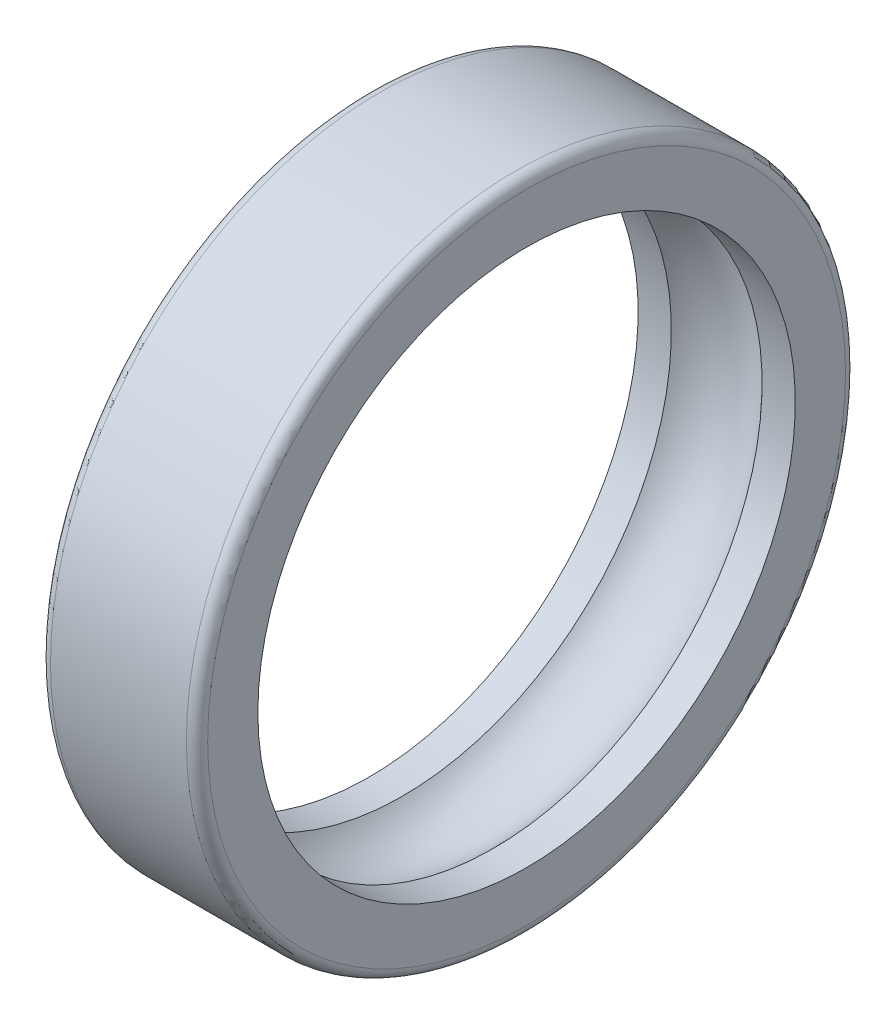
ISO-10303-21;
HEADER;
FILE_DESCRIPTION(('STEP AP214'),'2;1');
FILE_NAME('part.step','',(''),(''),'','','');
FILE_SCHEMA(('AUTOMOTIVE_DESIGN { 1 0 10303 214 1 1 1 1 }'));
ENDSEC;
DATA;
#1=APPLICATION_CONTEXT('core data for automotive mechanical design processes');
#2=APPLICATION_PROTOCOL_DEFINITION('international standard','automotive_design',2000,#1);
#3=PRODUCT_CONTEXT('',#1,'mechanical');
#4=PRODUCT('Part','Part','',(#3));
#5=PRODUCT_RELATED_PRODUCT_CATEGORY('part','',(#4));
#6=PRODUCT_DEFINITION_FORMATION('','',#4);
#7=PRODUCT_DEFINITION_CONTEXT('part definition',#1,'design');
#8=PRODUCT_DEFINITION('design','',#6,#7);
#9=PRODUCT_DEFINITION_SHAPE('','',#8);
#10=(LENGTH_UNIT() NAMED_UNIT(*) SI_UNIT(.MILLI.,.METRE.));
#11=(NAMED_UNIT(*) PLANE_ANGLE_UNIT() SI_UNIT($,.RADIAN.));
#12=(NAMED_UNIT(*) SI_UNIT($,.STERADIAN.) SOLID_ANGLE_UNIT());
#13=UNCERTAINTY_MEASURE_WITH_UNIT(LENGTH_MEASURE(1.E-05),#10,'distance_accuracy_value','');
#14=(GEOMETRIC_REPRESENTATION_CONTEXT(3) GLOBAL_UNCERTAINTY_ASSIGNED_CONTEXT((#13)) GLOBAL_UNIT_ASSIGNED_CONTEXT((#10,
#11,#12)) REPRESENTATION_CONTEXT('',''));
#15=CARTESIAN_POINT('',(0.,0.,0.));
#16=DIRECTION('',(0.,0.,1.));
#17=DIRECTION('',(1.,0.,0.));
#18=AXIS2_PLACEMENT_3D('',#15,#16,#17);
#19=CARTESIAN_POINT('',(-1.53709025069652,0.,0.));
#20=DIRECTION('',(-1.,0.,0.));
#21=DIRECTION('',(0.,0.,1.));
#22=AXIS2_PLACEMENT_3D('',#19,#20,#21);
#23=CYLINDRICAL_SURFACE('',#22,6.36);
#24=CARTESIAN_POINT('',(1.86,0.,0.));
#25=DIRECTION('',(-1.,0.,0.));
#26=DIRECTION('',(0.,0.,1.));
#27=AXIS2_PLACEMENT_3D('',#24,#25,#26);
#28=CIRCLE('',#27,6.36);
#29=CARTESIAN_POINT('',(1.86,0.,6.36));
#30=VERTEX_POINT('',#29);
#31=EDGE_CURVE('E67',#30,#30,#28,.T.);
#32=ORIENTED_EDGE('',*,*,#31,.F.);
#33=EDGE_LOOP('',(#32));
#34=FACE_BOUND('',#33,.T.);
#35=CARTESIAN_POINT('',(1.0733126291999,0.,0.));
#36=DIRECTION('',(-1.,0.,0.));
#37=DIRECTION('',(0.,0.,1.));
#38=AXIS2_PLACEMENT_3D('',#35,#36,#37);
#39=CIRCLE('',#38,6.36);
#40=CARTESIAN_POINT('',(1.0733126291999,0.,6.36));
#41=VERTEX_POINT('',#40);
#42=EDGE_CURVE('E58',#41,#41,#39,.T.);
#43=ORIENTED_EDGE('',*,*,#42,.T.);
#44=EDGE_LOOP('',(#43));
#45=FACE_BOUND('',#44,.T.);
#46=ADVANCED_FACE('F38',(#34,#45),#23,.F.);
#47=CARTESIAN_POINT('',(0.,0.,0.));
#48=DIRECTION('',(-1.,0.,0.));
#49=DIRECTION('',(0.,0.,1.));
#50=AXIS2_PLACEMENT_3D('',#47,#48,#49);
#51=TOROIDAL_SURFACE('',#50,5.4,1.44);
#52=ORIENTED_EDGE('',*,*,#42,.F.);
#53=EDGE_LOOP('',(#52));
#54=FACE_BOUND('',#53,.T.);
#55=CARTESIAN_POINT('',(-1.0733126291999,0.,0.));
#56=DIRECTION('',(-1.,0.,0.));
#57=DIRECTION('',(0.,0.,1.));
#58=AXIS2_PLACEMENT_3D('',#55,#56,#57);
#59=CIRCLE('',#58,6.36);
#60=CARTESIAN_POINT('',(-1.0733126291999,0.,6.36));
#61=VERTEX_POINT('',#60);
#62=EDGE_CURVE('E61',#61,#61,#59,.T.);
#63=ORIENTED_EDGE('',*,*,#62,.T.);
#64=EDGE_LOOP('',(#63));
#65=FACE_BOUND('',#64,.T.);
#66=ADVANCED_FACE('F75',(#54,#65),#51,.F.);
#67=CARTESIAN_POINT('',(-1.53709025069652,0.,0.));
#68=DIRECTION('',(-1.,0.,0.));
#69=DIRECTION('',(0.,0.,1.));
#70=AXIS2_PLACEMENT_3D('',#67,#68,#69);
#71=CYLINDRICAL_SURFACE('',#70,6.36);
#72=ORIENTED_EDGE('',*,*,#62,.F.);
#73=EDGE_LOOP('',(#72));
#74=FACE_BOUND('',#73,.T.);
#75=CARTESIAN_POINT('',(-1.86,0.,0.));
#76=DIRECTION('',(-1.,0.,0.));
#77=DIRECTION('',(0.,0.,1.));
#78=AXIS2_PLACEMENT_3D('',#75,#76,#77);
#79=CIRCLE('',#78,6.36);
#80=CARTESIAN_POINT('',(-1.86,0.,6.36));
#81=VERTEX_POINT('',#80);
#82=EDGE_CURVE('E64',#81,#81,#79,.T.);
#83=ORIENTED_EDGE('',*,*,#82,.T.);
#84=EDGE_LOOP('',(#83));
#85=FACE_BOUND('',#84,.T.);
#86=ADVANCED_FACE('F81',(#74,#85),#71,.F.);
#87=CARTESIAN_POINT('',(-1.86,7.8,0.));
#88=DIRECTION('',(1.,0.,0.));
#89=DIRECTION('',(0.,0.,-1.));
#90=AXIS2_PLACEMENT_3D('',#87,#88,#89);
#91=PLANE('',#90);
#92=CARTESIAN_POINT('',(-1.86,0.,0.));
#93=DIRECTION('',(1.,0.,0.));
#94=DIRECTION('',(0.,0.,-1.));
#95=AXIS2_PLACEMENT_3D('',#92,#93,#94);
#96=CIRCLE('',#95,7.548);
#97=CARTESIAN_POINT('',(-1.86,0.,-7.548));
#98=VERTEX_POINT('',#97);
#99=EDGE_CURVE('E10',#98,#98,#96,.F.);
#100=ORIENTED_EDGE('',*,*,#99,.T.);
#101=EDGE_LOOP('',(#100));
#102=FACE_BOUND('',#101,.T.);
#103=ORIENTED_EDGE('',*,*,#82,.F.);
#104=EDGE_LOOP('',(#103));
#105=FACE_BOUND('',#104,.T.);
#106=ADVANCED_FACE('F87',(#102,#105),#91,.F.);
#107=CARTESIAN_POINT('',(-1.53709025069652,0.,0.));
#108=DIRECTION('',(-1.,0.,0.));
#109=DIRECTION('',(0.,0.,1.));
#110=AXIS2_PLACEMENT_3D('',#107,#108,#109);
#111=CYLINDRICAL_SURFACE('',#110,7.8);
#112=CARTESIAN_POINT('',(1.608,0.,0.));
#113=DIRECTION('',(-1.,0.,0.));
#114=DIRECTION('',(0.,0.,1.));
#115=AXIS2_PLACEMENT_3D('',#112,#113,#114);
#116=CIRCLE('',#115,7.8);
#117=CARTESIAN_POINT('',(1.608,0.,7.8));
#118=VERTEX_POINT('',#117);
#119=EDGE_CURVE('E49',#118,#118,#116,.T.);
#120=ORIENTED_EDGE('',*,*,#119,.T.);
#121=EDGE_LOOP('',(#120));
#122=FACE_BOUND('',#121,.T.);
#123=CARTESIAN_POINT('',(-1.608,0.,0.));
#124=DIRECTION('',(1.,0.,0.));
#125=DIRECTION('',(0.,0.,-1.));
#126=AXIS2_PLACEMENT_3D('',#123,#124,#125);
#127=CIRCLE('',#126,7.8);
#128=CARTESIAN_POINT('',(-1.608,0.,-7.8));
#129=VERTEX_POINT('',#128);
#130=EDGE_CURVE('E53',#129,#129,#127,.T.);
#131=ORIENTED_EDGE('',*,*,#130,.T.);
#132=EDGE_LOOP('',(#131));
#133=FACE_BOUND('',#132,.T.);
#134=ADVANCED_FACE('F92',(#122,#133),#111,.T.);
#135=CARTESIAN_POINT('',(1.86,7.8,0.));
#136=DIRECTION('',(-1.,0.,0.));
#137=DIRECTION('',(0.,0.,1.));
#138=AXIS2_PLACEMENT_3D('',#135,#136,#137);
#139=PLANE('',#138);
#140=CARTESIAN_POINT('',(1.86,0.,0.));
#141=DIRECTION('',(-1.,0.,0.));
#142=DIRECTION('',(0.,0.,1.));
#143=AXIS2_PLACEMENT_3D('',#140,#141,#142);
#144=CIRCLE('',#143,7.548);
#145=CARTESIAN_POINT('',(1.86,0.,7.548));
#146=VERTEX_POINT('',#145);
#147=EDGE_CURVE('E45',#146,#146,#144,.F.);
#148=ORIENTED_EDGE('',*,*,#147,.T.);
#149=EDGE_LOOP('',(#148));
#150=FACE_BOUND('',#149,.T.);
#151=ORIENTED_EDGE('',*,*,#31,.T.);
#152=EDGE_LOOP('',(#151));
#153=FACE_BOUND('',#152,.T.);
#154=ADVANCED_FACE('F71',(#150,#153),#139,.F.);
#155=CARTESIAN_POINT('',(1.608,0.,0.));
#156=DIRECTION('',(-1.,0.,0.));
#157=DIRECTION('',(0.,0.,1.));
#158=AXIS2_PLACEMENT_3D('',#155,#156,#157);
#159=TOROIDAL_SURFACE('',#158,7.548,0.252);
#160=ORIENTED_EDGE('',*,*,#147,.F.);
#161=EDGE_LOOP('',(#160));
#162=FACE_BOUND('',#161,.T.);
#163=ORIENTED_EDGE('',*,*,#119,.F.);
#164=EDGE_LOOP('',(#163));
#165=FACE_BOUND('',#164,.T.);
#166=ADVANCED_FACE('F100',(#162,#165),#159,.T.);
#167=CARTESIAN_POINT('',(-1.608,0.,0.));
#168=DIRECTION('',(1.,0.,0.));
#169=DIRECTION('',(0.,0.,-1.));
#170=AXIS2_PLACEMENT_3D('',#167,#168,#169);
#171=TOROIDAL_SURFACE('',#170,7.548,0.252);
#172=ORIENTED_EDGE('',*,*,#130,.F.);
#173=EDGE_LOOP('',(#172));
#174=FACE_BOUND('',#173,.T.);
#175=ORIENTED_EDGE('',*,*,#99,.F.);
#176=EDGE_LOOP('',(#175));
#177=FACE_BOUND('',#176,.T.);
#178=ADVANCED_FACE('F40',(#174,#177),#171,.T.);
#179=CLOSED_SHELL('',(#46,#66,#86,#106,#134,#154,#166,#178));
#180=MANIFOLD_SOLID_BREP('B2',#179);
#181=ADVANCED_BREP_SHAPE_REPRESENTATION('',(#18,#180),#14);
#182=SHAPE_DEFINITION_REPRESENTATION(#9,#181);
ENDSEC;
END-ISO-10303-21;
